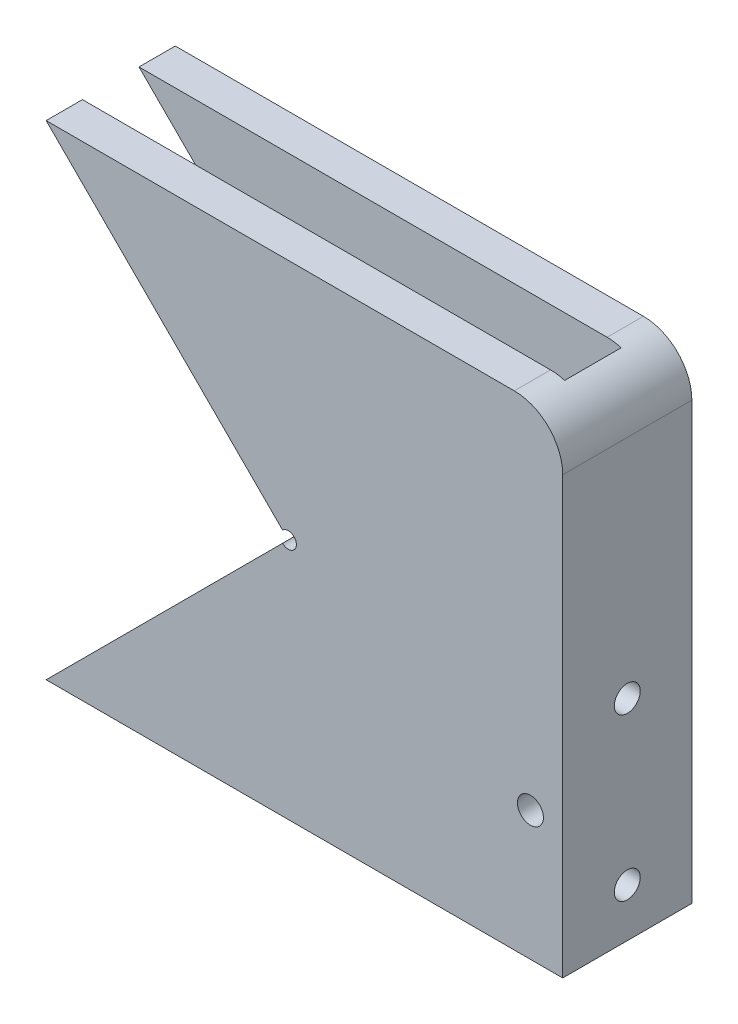
ISO-10303-21;
HEADER;
FILE_DESCRIPTION(('STEP AP214'),'2;1');
FILE_NAME('part.step','',(''),(''),'','','');
FILE_SCHEMA(('AUTOMOTIVE_DESIGN { 1 0 10303 214 1 1 1 1 }'));
ENDSEC;
DATA;
#1=APPLICATION_CONTEXT('core data for automotive mechanical design processes');
#2=APPLICATION_PROTOCOL_DEFINITION('international standard','automotive_design',2000,#1);
#3=PRODUCT_CONTEXT('',#1,'mechanical');
#4=PRODUCT('Part','Part','',(#3));
#5=PRODUCT_RELATED_PRODUCT_CATEGORY('part','',(#4));
#6=PRODUCT_DEFINITION_FORMATION('','',#4);
#7=PRODUCT_DEFINITION_CONTEXT('part definition',#1,'design');
#8=PRODUCT_DEFINITION('design','',#6,#7);
#9=PRODUCT_DEFINITION_SHAPE('','',#8);
#10=(LENGTH_UNIT() NAMED_UNIT(*) SI_UNIT(.MILLI.,.METRE.));
#11=(NAMED_UNIT(*) PLANE_ANGLE_UNIT() SI_UNIT($,.RADIAN.));
#12=(NAMED_UNIT(*) SI_UNIT($,.STERADIAN.) SOLID_ANGLE_UNIT());
#13=UNCERTAINTY_MEASURE_WITH_UNIT(LENGTH_MEASURE(1.E-05),#10,'distance_accuracy_value','');
#14=(GEOMETRIC_REPRESENTATION_CONTEXT(3) GLOBAL_UNCERTAINTY_ASSIGNED_CONTEXT((#13)) GLOBAL_UNIT_ASSIGNED_CONTEXT((#10,
#11,#12)) REPRESENTATION_CONTEXT('',''));
#15=CARTESIAN_POINT('',(0.,0.,0.));
#16=DIRECTION('',(0.,0.,1.));
#17=DIRECTION('',(1.,0.,0.));
#18=AXIS2_PLACEMENT_3D('',#15,#16,#17);
#19=CARTESIAN_POINT('',(-23.8125000000003,71.4375,12.7));
#20=DIRECTION('',(0.,1.,0.));
#21=DIRECTION('',(-1.,0.,0.));
#22=AXIS2_PLACEMENT_3D('',#19,#20,#21);
#23=PLANE('',#22);
#24=DIRECTION('',(1.,0.,0.));
#25=VECTOR('',#24,1.);
#26=CARTESIAN_POINT('',(-23.8125000000003,71.4375,12.7));
#27=LINE('',#26,#25);
#28=CARTESIAN_POINT('',(-23.8125000000003,71.4375,12.7));
#29=VERTEX_POINT('',#28);
#30=CARTESIAN_POINT('',(68.2624999999997,71.4375,12.7));
#31=VERTEX_POINT('',#30);
#32=EDGE_CURVE('E246',#29,#31,#27,.T.);
#33=ORIENTED_EDGE('',*,*,#32,.T.);
#34=DIRECTION('',(0.,0.,-1.));
#35=VECTOR('',#34,1.);
#36=CARTESIAN_POINT('',(68.2624999999997,71.4375,-12.7));
#37=LINE('',#36,#35);
#38=CARTESIAN_POINT('',(68.2624999999997,71.4375,5.5626));
#39=VERTEX_POINT('',#38);
#40=EDGE_CURVE('E328',#31,#39,#37,.T.);
#41=ORIENTED_EDGE('',*,*,#40,.T.);
#42=DIRECTION('',(-1.,0.,0.));
#43=VECTOR('',#42,1.);
#44=CARTESIAN_POINT('',(-23.8125000000003,71.4375,5.5626));
#45=LINE('',#44,#43);
#46=CARTESIAN_POINT('',(-23.8125000000002,71.4375,5.5626));
#47=VERTEX_POINT('',#46);
#48=EDGE_CURVE('E322',#39,#47,#45,.T.);
#49=ORIENTED_EDGE('',*,*,#48,.T.);
#50=DIRECTION('',(0.,0.,-1.));
#51=VECTOR('',#50,1.);
#52=CARTESIAN_POINT('',(-23.8125000000003,71.4375,12.7));
#53=LINE('',#52,#51);
#54=EDGE_CURVE('E260',#29,#47,#53,.T.);
#55=ORIENTED_EDGE('',*,*,#54,.F.);
#56=EDGE_LOOP('',(#33,#41,#49,#55));
#57=FACE_BOUND('',#56,.T.);
#58=ADVANCED_FACE('F47',(#57),#23,.T.);
#59=CARTESIAN_POINT('',(74.6124999999997,-26.9875,-5.5626));
#60=DIRECTION('',(0.707106781186551,0.707106781186544,0.));
#61=DIRECTION('',(-0.707106781186544,0.707106781186551,0.));
#62=AXIS2_PLACEMENT_3D('',#59,#60,#61);
#63=PLANE('',#62);
#64=DIRECTION('',(0.707106781186551,-0.707106781186544,0.));
#65=VECTOR('',#64,1.);
#66=CARTESIAN_POINT('',(-23.8125000000002,71.4375,5.5626));
#67=LINE('',#66,#65);
#68=CARTESIAN_POINT('',(22.6899679848666,24.9350320151337,5.5626));
#69=VERTEX_POINT('',#68);
#70=EDGE_CURVE('E230',#47,#69,#67,.T.);
#71=ORIENTED_EDGE('',*,*,#70,.T.);
#72=DIRECTION('',(0.,0.,1.));
#73=VECTOR('',#72,1.);
#74=CARTESIAN_POINT('',(22.6899679848666,24.9350320151337,-12.7));
#75=LINE('',#74,#73);
#76=CARTESIAN_POINT('',(22.6899679848666,24.9350320151336,12.7));
#77=VERTEX_POINT('',#76);
#78=EDGE_CURVE('E206',#69,#77,#75,.T.);
#79=ORIENTED_EDGE('',*,*,#78,.T.);
#80=DIRECTION('',(-0.707106781186551,0.707106781186544,0.));
#81=VECTOR('',#80,1.);
#82=CARTESIAN_POINT('',(23.8125000000002,23.8125,12.7));
#83=LINE('',#82,#81);
#84=EDGE_CURVE('E250',#77,#29,#83,.T.);
#85=ORIENTED_EDGE('',*,*,#84,.T.);
#86=ORIENTED_EDGE('',*,*,#54,.T.);
#87=EDGE_LOOP('',(#71,#79,#85,#86));
#88=FACE_BOUND('',#87,.T.);
#89=ADVANCED_FACE('F413',(#88),#63,.F.);
#90=CARTESIAN_POINT('',(61.9124999999998,-14.2875,0.));
#91=DIRECTION('',(0.707106781186551,0.707106781186544,0.));
#92=DIRECTION('',(0.707106781186544,-0.707106781186551,0.));
#93=AXIS2_PLACEMENT_3D('',#90,#91,#92);
#94=ELLIPSE('',#93,3.61006296066976,2.55269999999999);
#95=CARTESIAN_POINT('',(64.4651999999998,-16.8402,0.));
#96=VERTEX_POINT('',#95);
#97=EDGE_CURVE('E183',#96,#96,#94,.T.);
#98=ORIENTED_EDGE('',*,*,#97,.T.);
#99=EDGE_LOOP('',(#98));
#100=FACE_BOUND('',#99,.T.);
#101=DIRECTION('',(-0.707106781186544,0.707106781186551,0.));
#102=VECTOR('',#101,1.);
#103=CARTESIAN_POINT('',(74.6124999999997,-26.9875,5.5626));
#104=LINE('',#103,#102);
#105=CARTESIAN_POINT('',(71.4374999999997,-23.8125,5.5626));
#106=VERTEX_POINT('',#105);
#107=CARTESIAN_POINT('',(24.9350320151339,22.6899679848664,5.5626));
#108=VERTEX_POINT('',#107);
#109=EDGE_CURVE('E271',#106,#108,#104,.T.);
#110=ORIENTED_EDGE('',*,*,#109,.T.);
#111=DIRECTION('',(0.,0.,1.));
#112=VECTOR('',#111,1.);
#113=CARTESIAN_POINT('',(24.9350320151339,22.6899679848664,-12.7));
#114=LINE('',#113,#112);
#115=CARTESIAN_POINT('',(24.9350320151339,22.6899679848664,-5.5626));
#116=VERTEX_POINT('',#115);
#117=EDGE_CURVE('E218',#108,#116,#114,.F.);
#118=ORIENTED_EDGE('',*,*,#117,.T.);
#119=DIRECTION('',(-0.707106781186544,0.707106781186551,0.));
#120=VECTOR('',#119,1.);
#121=CARTESIAN_POINT('',(74.6124999999997,-26.9875,-5.5626));
#122=LINE('',#121,#120);
#123=CARTESIAN_POINT('',(71.4374999999997,-23.8125,-5.5626));
#124=VERTEX_POINT('',#123);
#125=EDGE_CURVE('E272',#124,#116,#122,.T.);
#126=ORIENTED_EDGE('',*,*,#125,.F.);
#127=DIRECTION('',(0.,0.,-1.));
#128=VECTOR('',#127,1.);
#129=CARTESIAN_POINT('',(71.4374999999997,-23.8125,12.7));
#130=LINE('',#129,#128);
#131=EDGE_CURVE('E306',#106,#124,#130,.T.);
#132=ORIENTED_EDGE('',*,*,#131,.F.);
#133=EDGE_LOOP('',(#110,#118,#126,#132));
#134=FACE_BOUND('',#133,.T.);
#135=ADVANCED_FACE('F407',(#100,#134),#63,.F.);
#136=DIRECTION('',(-0.707106781186551,0.707106781186544,0.));
#137=VECTOR('',#136,1.);
#138=CARTESIAN_POINT('',(23.8125000000002,23.8125,-12.7));
#139=LINE('',#138,#137);
#140=CARTESIAN_POINT('',(22.6899679848666,24.9350320151336,-12.7));
#141=VERTEX_POINT('',#140);
#142=CARTESIAN_POINT('',(-23.8125000000003,71.4375,-12.7));
#143=VERTEX_POINT('',#142);
#144=EDGE_CURVE('E251',#141,#143,#139,.T.);
#145=ORIENTED_EDGE('',*,*,#144,.F.);
#146=DIRECTION('',(0.,0.,1.));
#147=VECTOR('',#146,1.);
#148=CARTESIAN_POINT('',(22.6899679848666,24.9350320151337,-12.7));
#149=LINE('',#148,#147);
#150=CARTESIAN_POINT('',(22.6899679848666,24.9350320151337,-5.5626));
#151=VERTEX_POINT('',#150);
#152=EDGE_CURVE('E202',#141,#151,#149,.T.);
#153=ORIENTED_EDGE('',*,*,#152,.T.);
#154=DIRECTION('',(-0.707106781186551,0.707106781186544,0.));
#155=VECTOR('',#154,1.);
#156=CARTESIAN_POINT('',(-23.8125000000002,71.4375,-5.5626));
#157=LINE('',#156,#155);
#158=CARTESIAN_POINT('',(-23.8125000000002,71.4375,-5.5626));
#159=VERTEX_POINT('',#158);
#160=EDGE_CURVE('E234',#151,#159,#157,.T.);
#161=ORIENTED_EDGE('',*,*,#160,.T.);
#162=EDGE_CURVE('E254',#159,#143,#53,.T.);
#163=ORIENTED_EDGE('',*,*,#162,.T.);
#164=EDGE_LOOP('',(#145,#153,#161,#163));
#165=FACE_BOUND('',#164,.T.);
#166=ADVANCED_FACE('F383',(#165),#63,.F.);
#167=DIRECTION('',(1.,0.,0.));
#168=VECTOR('',#167,1.);
#169=CARTESIAN_POINT('',(-23.8125000000003,71.4375,-5.5626));
#170=LINE('',#169,#168);
#171=CARTESIAN_POINT('',(68.2624999999997,71.4375,-5.5626));
#172=VERTEX_POINT('',#171);
#173=EDGE_CURVE('E318',#159,#172,#170,.T.);
#174=ORIENTED_EDGE('',*,*,#173,.T.);
#175=DIRECTION('',(0.,0.,-1.));
#176=VECTOR('',#175,1.);
#177=CARTESIAN_POINT('',(68.2624999999997,71.4375,-12.7));
#178=LINE('',#177,#176);
#179=CARTESIAN_POINT('',(68.2624999999997,71.4375,-12.7));
#180=VERTEX_POINT('',#179);
#181=EDGE_CURVE('E325',#172,#180,#178,.T.);
#182=ORIENTED_EDGE('',*,*,#181,.T.);
#183=DIRECTION('',(1.,0.,0.));
#184=VECTOR('',#183,1.);
#185=CARTESIAN_POINT('',(-23.8125000000003,71.4375,-12.7));
#186=LINE('',#185,#184);
#187=EDGE_CURVE('E242',#143,#180,#186,.T.);
#188=ORIENTED_EDGE('',*,*,#187,.F.);
#189=ORIENTED_EDGE('',*,*,#162,.F.);
#190=EDGE_LOOP('',(#174,#182,#188,#189));
#191=FACE_BOUND('',#190,.T.);
#192=ADVANCED_FACE('F374',(#191),#23,.T.);
#193=CARTESIAN_POINT('',(23.8125000000002,23.8125,12.7));
#194=DIRECTION('',(0.707106781186544,-0.707106781186551,0.));
#195=DIRECTION('',(0.707106781186551,0.707106781186544,0.));
#196=AXIS2_PLACEMENT_3D('',#193,#194,#195);
#197=PLANE('',#196);
#198=DIRECTION('',(-0.707106781186551,-0.707106781186544,0.));
#199=VECTOR('',#198,1.);
#200=CARTESIAN_POINT('',(23.8125000000002,23.8125,12.7));
#201=LINE('',#200,#199);
#202=CARTESIAN_POINT('',(22.6899679848666,22.6899679848664,12.7));
#203=VERTEX_POINT('',#202);
#204=CARTESIAN_POINT('',(-23.8125000000002,-23.8125,12.7));
#205=VERTEX_POINT('',#204);
#206=EDGE_CURVE('E280',#203,#205,#201,.T.);
#207=ORIENTED_EDGE('',*,*,#206,.F.);
#208=DIRECTION('',(0.,0.,1.));
#209=VECTOR('',#208,1.);
#210=CARTESIAN_POINT('',(22.6899679848666,22.6899679848664,-12.7));
#211=LINE('',#210,#209);
#212=CARTESIAN_POINT('',(22.6899679848666,22.6899679848664,5.5626));
#213=VERTEX_POINT('',#212);
#214=EDGE_CURVE('E226',#203,#213,#211,.F.);
#215=ORIENTED_EDGE('',*,*,#214,.T.);
#216=DIRECTION('',(0.707106781186551,0.707106781186544,0.));
#217=VECTOR('',#216,1.);
#218=CARTESIAN_POINT('',(-23.8125000000002,-23.8125,5.5626));
#219=LINE('',#218,#217);
#220=CARTESIAN_POINT('',(-23.8125000000002,-23.8125,5.5626));
#221=VERTEX_POINT('',#220);
#222=EDGE_CURVE('E264',#221,#213,#219,.T.);
#223=ORIENTED_EDGE('',*,*,#222,.F.);
#224=DIRECTION('',(0.,0.,-1.));
#225=VECTOR('',#224,1.);
#226=CARTESIAN_POINT('',(-23.8125000000002,-23.8125,12.7));
#227=LINE('',#226,#225);
#228=EDGE_CURVE('E302',#205,#221,#227,.T.);
#229=ORIENTED_EDGE('',*,*,#228,.F.);
#230=EDGE_LOOP('',(#207,#215,#223,#229));
#231=FACE_BOUND('',#230,.T.);
#232=ADVANCED_FACE('F402',(#231),#197,.F.);
#233=DIRECTION('',(-0.707106781186551,-0.707106781186544,0.));
#234=VECTOR('',#233,1.);
#235=CARTESIAN_POINT('',(-23.8125000000002,-23.8125,-5.5626));
#236=LINE('',#235,#234);
#237=CARTESIAN_POINT('',(22.6899679848666,22.6899679848664,-5.5626));
#238=VERTEX_POINT('',#237);
#239=CARTESIAN_POINT('',(-23.8125000000002,-23.8125,-5.5626));
#240=VERTEX_POINT('',#239);
#241=EDGE_CURVE('E268',#238,#240,#236,.T.);
#242=ORIENTED_EDGE('',*,*,#241,.F.);
#243=DIRECTION('',(0.,0.,1.));
#244=VECTOR('',#243,1.);
#245=CARTESIAN_POINT('',(22.6899679848666,22.6899679848664,-12.7));
#246=LINE('',#245,#244);
#247=CARTESIAN_POINT('',(22.6899679848666,22.6899679848664,-12.7));
#248=VERTEX_POINT('',#247);
#249=EDGE_CURVE('E214',#238,#248,#246,.F.);
#250=ORIENTED_EDGE('',*,*,#249,.T.);
#251=DIRECTION('',(-0.707106781186551,-0.707106781186544,0.));
#252=VECTOR('',#251,1.);
#253=CARTESIAN_POINT('',(23.8125000000002,23.8125,-12.7));
#254=LINE('',#253,#252);
#255=CARTESIAN_POINT('',(-23.8125000000002,-23.8125,-12.7));
#256=VERTEX_POINT('',#255);
#257=EDGE_CURVE('E276',#248,#256,#254,.T.);
#258=ORIENTED_EDGE('',*,*,#257,.T.);
#259=EDGE_CURVE('E301',#240,#256,#227,.T.);
#260=ORIENTED_EDGE('',*,*,#259,.F.);
#261=EDGE_LOOP('',(#242,#250,#258,#260));
#262=FACE_BOUND('',#261,.T.);
#263=ADVANCED_FACE('F410',(#262),#197,.F.);
#264=CARTESIAN_POINT('',(-23.8125000000002,-23.8125,12.7));
#265=DIRECTION('',(0.,1.,0.));
#266=DIRECTION('',(0.,0.,1.));
#267=AXIS2_PLACEMENT_3D('',#264,#265,#266);
#268=PLANE('',#267);
#269=ORIENTED_EDGE('',*,*,#228,.T.);
#270=DIRECTION('',(1.,0.,0.));
#271=VECTOR('',#270,1.);
#272=CARTESIAN_POINT('',(-23.8125000000002,-23.8125,5.5626));
#273=LINE('',#272,#271);
#274=EDGE_CURVE('E314',#221,#106,#273,.T.);
#275=ORIENTED_EDGE('',*,*,#274,.T.);
#276=ORIENTED_EDGE('',*,*,#131,.T.);
#277=DIRECTION('',(-1.,0.,0.));
#278=VECTOR('',#277,1.);
#279=CARTESIAN_POINT('',(-23.8125000000002,-23.8125,-5.5626));
#280=LINE('',#279,#278);
#281=EDGE_CURVE('E310',#124,#240,#280,.T.);
#282=ORIENTED_EDGE('',*,*,#281,.T.);
#283=ORIENTED_EDGE('',*,*,#259,.T.);
#284=DIRECTION('',(1.,0.,0.));
#285=VECTOR('',#284,1.);
#286=CARTESIAN_POINT('',(-23.8125000000002,-23.8125,-12.7));
#287=LINE('',#286,#285);
#288=CARTESIAN_POINT('',(77.7874999999997,-23.8125,-12.7));
#289=VERTEX_POINT('',#288);
#290=EDGE_CURVE('E293',#256,#289,#287,.T.);
#291=ORIENTED_EDGE('',*,*,#290,.T.);
#292=DIRECTION('',(0.,0.,-1.));
#293=VECTOR('',#292,1.);
#294=CARTESIAN_POINT('',(77.7874999999997,-23.8125,12.7));
#295=LINE('',#294,#293);
#296=CARTESIAN_POINT('',(77.7874999999997,-23.8125,12.7));
#297=VERTEX_POINT('',#296);
#298=EDGE_CURVE('E290',#297,#289,#295,.T.);
#299=ORIENTED_EDGE('',*,*,#298,.F.);
#300=DIRECTION('',(1.,0.,0.));
#301=VECTOR('',#300,1.);
#302=CARTESIAN_POINT('',(-23.8125000000002,-23.8125,12.7));
#303=LINE('',#302,#301);
#304=EDGE_CURVE('E283',#205,#297,#303,.T.);
#305=ORIENTED_EDGE('',*,*,#304,.F.);
#306=EDGE_LOOP('',(#269,#275,#276,#282,#283,#291,#299,#305));
#307=FACE_BOUND('',#306,.T.);
#308=ADVANCED_FACE('F390',(#307),#268,.F.);
#309=CARTESIAN_POINT('',(77.7874999999997,-23.8125,12.7));
#310=DIRECTION('',(-1.,0.,0.));
#311=DIRECTION('',(0.,0.,1.));
#312=AXIS2_PLACEMENT_3D('',#309,#310,#311);
#313=PLANE('',#312);
#314=CARTESIAN_POINT('',(77.7874999999997,-14.2875,0.));
#315=DIRECTION('',(1.,0.,0.));
#316=DIRECTION('',(0.,0.,-1.));
#317=AXIS2_PLACEMENT_3D('',#314,#315,#316);
#318=CIRCLE('',#317,2.55269999999999);
#319=CARTESIAN_POINT('',(77.7874999999997,-14.2875,-2.55269999999999));
#320=VERTEX_POINT('',#319);
#321=EDGE_CURVE('E569',#320,#320,#318,.T.);
#322=ORIENTED_EDGE('',*,*,#321,.F.);
#323=EDGE_LOOP('',(#322));
#324=FACE_BOUND('',#323,.T.);
#325=CARTESIAN_POINT('',(77.7874999999997,17.4625,0.));
#326=DIRECTION('',(1.,0.,0.));
#327=DIRECTION('',(0.,0.,-1.));
#328=AXIS2_PLACEMENT_3D('',#325,#326,#327);
#329=CIRCLE('',#328,2.55269999999999);
#330=CARTESIAN_POINT('',(77.7874999999997,17.4625,-2.55269999999999));
#331=VERTEX_POINT('',#330);
#332=EDGE_CURVE('E175',#331,#331,#329,.T.);
#333=ORIENTED_EDGE('',*,*,#332,.F.);
#334=EDGE_LOOP('',(#333));
#335=FACE_BOUND('',#334,.T.);
#336=DIRECTION('',(0.,1.,0.));
#337=VECTOR('',#336,1.);
#338=CARTESIAN_POINT('',(77.7874999999997,-23.8125,-12.7));
#339=LINE('',#338,#337);
#340=CARTESIAN_POINT('',(77.7874999999997,61.9125,-12.7));
#341=VERTEX_POINT('',#340);
#342=EDGE_CURVE('E284',#289,#341,#339,.T.);
#343=ORIENTED_EDGE('',*,*,#342,.T.);
#344=DIRECTION('',(0.,0.,-1.));
#345=VECTOR('',#344,1.);
#346=CARTESIAN_POINT('',(77.7874999999997,61.9125,12.7));
#347=LINE('',#346,#345);
#348=CARTESIAN_POINT('',(77.7874999999997,61.9125,12.7));
#349=VERTEX_POINT('',#348);
#350=EDGE_CURVE('E70',#341,#349,#347,.F.);
#351=ORIENTED_EDGE('',*,*,#350,.T.);
#352=DIRECTION('',(0.,1.,0.));
#353=VECTOR('',#352,1.);
#354=CARTESIAN_POINT('',(77.7874999999997,-23.8125,12.7));
#355=LINE('',#354,#353);
#356=EDGE_CURVE('E287',#297,#349,#355,.T.);
#357=ORIENTED_EDGE('',*,*,#356,.F.);
#358=ORIENTED_EDGE('',*,*,#298,.T.);
#359=EDGE_LOOP('',(#343,#351,#357,#358));
#360=FACE_BOUND('',#359,.T.);
#361=ADVANCED_FACE('F395',(#324,#335,#360),#313,.F.);
#362=CARTESIAN_POINT('',(0.,0.,12.7));
#363=DIRECTION('',(0.,0.,-1.));
#364=DIRECTION('',(-1.,0.,0.));
#365=AXIS2_PLACEMENT_3D('',#362,#363,#364);
#366=PLANE('',#365);
#367=CARTESIAN_POINT('',(71.4374999999997,1.58750000000001,12.7));
#368=DIRECTION('',(0.,0.,1.));
#369=DIRECTION('',(1.,0.,0.));
#370=AXIS2_PLACEMENT_3D('',#367,#368,#369);
#371=CIRCLE('',#370,2.55269999999999);
#372=CARTESIAN_POINT('',(73.9901999999997,1.58750000000001,12.7));
#373=VERTEX_POINT('',#372);
#374=EDGE_CURVE('E174',#373,#373,#371,.T.);
#375=ORIENTED_EDGE('',*,*,#374,.F.);
#376=EDGE_LOOP('',(#375));
#377=FACE_BOUND('',#376,.T.);
#378=ORIENTED_EDGE('',*,*,#84,.F.);
#379=CARTESIAN_POINT('',(23.8125000000002,23.8125,12.7));
#380=DIRECTION('',(0.,0.,1.));
#381=DIRECTION('',(1.,0.,0.));
#382=AXIS2_PLACEMENT_3D('',#379,#380,#381);
#383=CIRCLE('',#382,1.5875);
#384=EDGE_CURVE('E190',#203,#77,#383,.T.);
#385=ORIENTED_EDGE('',*,*,#384,.F.);
#386=ORIENTED_EDGE('',*,*,#206,.T.);
#387=ORIENTED_EDGE('',*,*,#304,.T.);
#388=ORIENTED_EDGE('',*,*,#356,.T.);
#389=CARTESIAN_POINT('',(68.2624999999997,61.9125,12.7));
#390=DIRECTION('',(0.,0.,-1.));
#391=DIRECTION('',(-1.,0.,0.));
#392=AXIS2_PLACEMENT_3D('',#389,#390,#391);
#393=CIRCLE('',#392,9.525);
#394=EDGE_CURVE('E56',#349,#31,#393,.F.);
#395=ORIENTED_EDGE('',*,*,#394,.T.);
#396=ORIENTED_EDGE('',*,*,#32,.F.);
#397=EDGE_LOOP('',(#378,#385,#386,#387,#388,#395,#396));
#398=FACE_BOUND('',#397,.T.);
#399=ADVANCED_FACE('F350',(#377,#398),#366,.F.);
#400=CARTESIAN_POINT('',(0.,0.,-12.7));
#401=DIRECTION('',(0.,0.,-1.));
#402=DIRECTION('',(-1.,0.,0.));
#403=AXIS2_PLACEMENT_3D('',#400,#401,#402);
#404=PLANE('',#403);
#405=CARTESIAN_POINT('',(71.4374999999997,1.58750000000001,-12.7));
#406=DIRECTION('',(0.,0.,1.));
#407=DIRECTION('',(1.,0.,0.));
#408=AXIS2_PLACEMENT_3D('',#405,#406,#407);
#409=CIRCLE('',#408,2.55269999999999);
#410=CARTESIAN_POINT('',(73.9901999999997,1.58750000000001,-12.7));
#411=VERTEX_POINT('',#410);
#412=EDGE_CURVE('E180',#411,#411,#409,.T.);
#413=ORIENTED_EDGE('',*,*,#412,.T.);
#414=EDGE_LOOP('',(#413));
#415=FACE_BOUND('',#414,.T.);
#416=CARTESIAN_POINT('',(23.8125000000002,23.8125,-12.7));
#417=DIRECTION('',(0.,0.,1.));
#418=DIRECTION('',(1.,0.,0.));
#419=AXIS2_PLACEMENT_3D('',#416,#417,#418);
#420=CIRCLE('',#419,1.5875);
#421=EDGE_CURVE('E191',#248,#141,#420,.T.);
#422=ORIENTED_EDGE('',*,*,#421,.T.);
#423=ORIENTED_EDGE('',*,*,#144,.T.);
#424=ORIENTED_EDGE('',*,*,#187,.T.);
#425=CARTESIAN_POINT('',(68.2624999999997,61.9125,-12.7));
#426=DIRECTION('',(0.,0.,-1.));
#427=DIRECTION('',(-1.,0.,0.));
#428=AXIS2_PLACEMENT_3D('',#425,#426,#427);
#429=CIRCLE('',#428,9.525);
#430=EDGE_CURVE('E341',#180,#341,#429,.T.);
#431=ORIENTED_EDGE('',*,*,#430,.T.);
#432=ORIENTED_EDGE('',*,*,#342,.F.);
#433=ORIENTED_EDGE('',*,*,#290,.F.);
#434=ORIENTED_EDGE('',*,*,#257,.F.);
#435=EDGE_LOOP('',(#422,#423,#424,#431,#432,#433,#434));
#436=FACE_BOUND('',#435,.T.);
#437=ADVANCED_FACE('F377',(#415,#436),#404,.T.);
#438=CARTESIAN_POINT('',(26.9874999999992,-74.6125,5.5626));
#439=DIRECTION('',(0.,0.,1.));
#440=DIRECTION('',(1.,0.,0.));
#441=AXIS2_PLACEMENT_3D('',#438,#439,#440);
#442=PLANE('',#441);
#443=ORIENTED_EDGE('',*,*,#222,.T.);
#444=CARTESIAN_POINT('',(23.8125000000002,23.8125,5.5626));
#445=DIRECTION('',(0.,0.,1.));
#446=DIRECTION('',(1.,0.,0.));
#447=AXIS2_PLACEMENT_3D('',#444,#445,#446);
#448=CIRCLE('',#447,1.5875);
#449=EDGE_CURVE('E222',#213,#108,#448,.T.);
#450=ORIENTED_EDGE('',*,*,#449,.T.);
#451=ORIENTED_EDGE('',*,*,#109,.F.);
#452=ORIENTED_EDGE('',*,*,#274,.F.);
#453=EDGE_LOOP('',(#443,#450,#451,#452));
#454=FACE_BOUND('',#453,.T.);
#455=ADVANCED_FACE('F404',(#454),#442,.F.);
#456=CARTESIAN_POINT('',(26.9874999999992,-74.6125,-5.5626));
#457=DIRECTION('',(0.,0.,-1.));
#458=DIRECTION('',(-1.,0.,0.));
#459=AXIS2_PLACEMENT_3D('',#456,#457,#458);
#460=PLANE('',#459);
#461=ORIENTED_EDGE('',*,*,#125,.T.);
#462=CARTESIAN_POINT('',(23.8125000000002,23.8125,-5.5626));
#463=DIRECTION('',(0.,0.,-1.));
#464=DIRECTION('',(-1.,0.,0.));
#465=AXIS2_PLACEMENT_3D('',#462,#463,#464);
#466=CIRCLE('',#465,1.5875);
#467=EDGE_CURVE('E210',#116,#238,#466,.T.);
#468=ORIENTED_EDGE('',*,*,#467,.T.);
#469=ORIENTED_EDGE('',*,*,#241,.T.);
#470=ORIENTED_EDGE('',*,*,#281,.F.);
#471=EDGE_LOOP('',(#461,#468,#469,#470));
#472=FACE_BOUND('',#471,.T.);
#473=ADVANCED_FACE('F409',(#472),#460,.F.);
#474=CARTESIAN_POINT('',(26.9874999999992,122.2375,5.5626));
#475=DIRECTION('',(0.,0.,-1.));
#476=DIRECTION('',(-1.,0.,0.));
#477=AXIS2_PLACEMENT_3D('',#474,#475,#476);
#478=PLANE('',#477);
#479=CARTESIAN_POINT('',(23.8125000000002,23.8125,5.5626));
#480=DIRECTION('',(0.,0.,-1.));
#481=DIRECTION('',(-1.,0.,0.));
#482=AXIS2_PLACEMENT_3D('',#479,#480,#481);
#483=CIRCLE('',#482,1.5875);
#484=CARTESIAN_POINT('',(24.9350320151339,24.9350320151337,5.5626));
#485=VERTEX_POINT('',#484);
#486=EDGE_CURVE('E199',#69,#485,#483,.T.);
#487=ORIENTED_EDGE('',*,*,#486,.F.);
#488=ORIENTED_EDGE('',*,*,#70,.F.);
#489=ORIENTED_EDGE('',*,*,#48,.F.);
#490=CARTESIAN_POINT('',(68.2624999999997,61.9125,5.5626));
#491=DIRECTION('',(0.,0.,-1.));
#492=DIRECTION('',(-1.,0.,0.));
#493=AXIS2_PLACEMENT_3D('',#490,#491,#492);
#494=CIRCLE('',#493,9.525);
#495=CARTESIAN_POINT('',(71.0273811015034,71.0273811015036,5.5626));
#496=VERTEX_POINT('',#495);
#497=EDGE_CURVE('E332',#39,#496,#494,.T.);
#498=ORIENTED_EDGE('',*,*,#497,.T.);
#499=DIRECTION('',(-0.707106781186544,-0.707106781186551,0.));
#500=VECTOR('',#499,1.);
#501=CARTESIAN_POINT('',(74.6124999999997,74.6125,5.5626));
#502=LINE('',#501,#500);
#503=EDGE_CURVE('E238',#496,#485,#502,.T.);
#504=ORIENTED_EDGE('',*,*,#503,.T.);
#505=EDGE_LOOP('',(#487,#488,#489,#498,#504));
#506=FACE_BOUND('',#505,.T.);
#507=ADVANCED_FACE('F361',(#506),#478,.T.);
#508=CARTESIAN_POINT('',(74.6124999999997,74.6125,-5.5626));
#509=DIRECTION('',(-0.707106781186551,0.707106781186544,0.));
#510=DIRECTION('',(-0.707106781186544,-0.707106781186551,0.));
#511=AXIS2_PLACEMENT_3D('',#508,#509,#510);
#512=PLANE('',#511);
#513=DIRECTION('',(0.,0.,1.));
#514=VECTOR('',#513,1.);
#515=CARTESIAN_POINT('',(24.9350320151339,24.9350320151337,-12.7));
#516=LINE('',#515,#514);
#517=CARTESIAN_POINT('',(24.9350320151339,24.9350320151337,-5.5626));
#518=VERTEX_POINT('',#517);
#519=EDGE_CURVE('E62',#485,#518,#516,.F.);
#520=ORIENTED_EDGE('',*,*,#519,.F.);
#521=ORIENTED_EDGE('',*,*,#503,.F.);
#522=DIRECTION('',(0.,0.,1.));
#523=VECTOR('',#522,1.);
#524=CARTESIAN_POINT('',(71.0273811015034,71.0273811015036,5.5626));
#525=LINE('',#524,#523);
#526=CARTESIAN_POINT('',(71.0273811015034,71.0273811015036,-5.5626));
#527=VERTEX_POINT('',#526);
#528=EDGE_CURVE('E335',#496,#527,#525,.F.);
#529=ORIENTED_EDGE('',*,*,#528,.T.);
#530=DIRECTION('',(-0.707106781186544,-0.707106781186551,0.));
#531=VECTOR('',#530,1.);
#532=CARTESIAN_POINT('',(74.6124999999997,74.6125,-5.5626));
#533=LINE('',#532,#531);
#534=EDGE_CURVE('E237',#527,#518,#533,.T.);
#535=ORIENTED_EDGE('',*,*,#534,.T.);
#536=EDGE_LOOP('',(#520,#521,#529,#535));
#537=FACE_BOUND('',#536,.T.);
#538=ADVANCED_FACE('F364',(#537),#512,.T.);
#539=CARTESIAN_POINT('',(26.9874999999992,122.2375,-5.5626));
#540=DIRECTION('',(0.,0.,1.));
#541=DIRECTION('',(1.,0.,0.));
#542=AXIS2_PLACEMENT_3D('',#539,#540,#541);
#543=PLANE('',#542);
#544=CARTESIAN_POINT('',(23.8125000000002,23.8125,-5.5626));
#545=DIRECTION('',(0.,0.,1.));
#546=DIRECTION('',(1.,0.,0.));
#547=AXIS2_PLACEMENT_3D('',#544,#545,#546);
#548=CIRCLE('',#547,1.5875);
#549=EDGE_CURVE('E11',#518,#151,#548,.T.);
#550=ORIENTED_EDGE('',*,*,#549,.F.);
#551=ORIENTED_EDGE('',*,*,#534,.F.);
#552=CARTESIAN_POINT('',(68.2624999999997,61.9125,-5.5626));
#553=DIRECTION('',(0.,0.,1.));
#554=DIRECTION('',(1.,0.,0.));
#555=AXIS2_PLACEMENT_3D('',#552,#553,#554);
#556=CIRCLE('',#555,9.525);
#557=EDGE_CURVE('E338',#527,#172,#556,.T.);
#558=ORIENTED_EDGE('',*,*,#557,.T.);
#559=ORIENTED_EDGE('',*,*,#173,.F.);
#560=ORIENTED_EDGE('',*,*,#160,.F.);
#561=EDGE_LOOP('',(#550,#551,#558,#559,#560));
#562=FACE_BOUND('',#561,.T.);
#563=ADVANCED_FACE('F367',(#562),#543,.T.);
#564=CARTESIAN_POINT('',(68.2624999999997,61.9125,12.7));
#565=DIRECTION('',(0.,0.,1.));
#566=DIRECTION('',(1.,0.,0.));
#567=AXIS2_PLACEMENT_3D('',#564,#565,#566);
#568=CYLINDRICAL_SURFACE('',#567,9.525);
#569=ORIENTED_EDGE('',*,*,#394,.F.);
#570=ORIENTED_EDGE('',*,*,#350,.F.);
#571=ORIENTED_EDGE('',*,*,#430,.F.);
#572=ORIENTED_EDGE('',*,*,#181,.F.);
#573=ORIENTED_EDGE('',*,*,#557,.F.);
#574=ORIENTED_EDGE('',*,*,#528,.F.);
#575=ORIENTED_EDGE('',*,*,#497,.F.);
#576=ORIENTED_EDGE('',*,*,#40,.F.);
#577=EDGE_LOOP('',(#569,#570,#571,#572,#573,#574,#575,#576));
#578=FACE_BOUND('',#577,.T.);
#579=ADVANCED_FACE('F49',(#578),#568,.T.);
#580=CARTESIAN_POINT('',(23.8125000000002,23.8125,-12.7));
#581=DIRECTION('',(0.,0.,1.));
#582=DIRECTION('',(1.,0.,0.));
#583=AXIS2_PLACEMENT_3D('',#580,#581,#582);
#584=CYLINDRICAL_SURFACE('',#583,1.5875);
#585=ORIENTED_EDGE('',*,*,#384,.T.);
#586=ORIENTED_EDGE('',*,*,#78,.F.);
#587=ORIENTED_EDGE('',*,*,#486,.T.);
#588=ORIENTED_EDGE('',*,*,#519,.T.);
#589=ORIENTED_EDGE('',*,*,#549,.T.);
#590=ORIENTED_EDGE('',*,*,#152,.F.);
#591=ORIENTED_EDGE('',*,*,#421,.F.);
#592=ORIENTED_EDGE('',*,*,#249,.F.);
#593=ORIENTED_EDGE('',*,*,#467,.F.);
#594=ORIENTED_EDGE('',*,*,#117,.F.);
#595=ORIENTED_EDGE('',*,*,#449,.F.);
#596=ORIENTED_EDGE('',*,*,#214,.F.);
#597=EDGE_LOOP('',(#585,#586,#587,#588,#589,#590,#591,#592,#593,#594,#595,#596));
#598=FACE_BOUND('',#597,.T.);
#599=ADVANCED_FACE('F411',(#598),#584,.F.);
#600=CARTESIAN_POINT('',(71.4374999999997,1.58750000000001,12.7));
#601=DIRECTION('',(0.,0.,1.));
#602=DIRECTION('',(1.,0.,0.));
#603=AXIS2_PLACEMENT_3D('',#600,#601,#602);
#604=CYLINDRICAL_SURFACE('',#603,2.55269999999999);
#605=ORIENTED_EDGE('',*,*,#412,.F.);
#606=EDGE_LOOP('',(#605));
#607=FACE_BOUND('',#606,.T.);
#608=ORIENTED_EDGE('',*,*,#374,.T.);
#609=EDGE_LOOP('',(#608));
#610=FACE_BOUND('',#609,.T.);
#611=ADVANCED_FACE('F167',(#607,#610),#604,.F.);
#612=CARTESIAN_POINT('',(61.9124999999997,17.4625,0.));
#613=DIRECTION('',(1.,0.,0.));
#614=DIRECTION('',(0.,0.,-1.));
#615=AXIS2_PLACEMENT_3D('',#612,#613,#614);
#616=CONICAL_SURFACE('',#615,2.55269999999999,1.02974425867665);
#617=CARTESIAN_POINT('',(60.3786830978081,17.4625,0.));
#618=VERTEX_POINT('',#617);
#619=VERTEX_LOOP('',#618);
#620=FACE_BOUND('',#619,.T.);
#621=CARTESIAN_POINT('',(61.9124999999997,17.4625,0.));
#622=DIRECTION('',(1.,0.,0.));
#623=DIRECTION('',(0.,0.,-1.));
#624=AXIS2_PLACEMENT_3D('',#621,#622,#623);
#625=CIRCLE('',#624,2.55269999999999);
#626=CARTESIAN_POINT('',(61.9124999999997,17.4625,-2.55269999999999));
#627=VERTEX_POINT('',#626);
#628=EDGE_CURVE('E171',#627,#627,#625,.T.);
#629=ORIENTED_EDGE('',*,*,#628,.T.);
#630=EDGE_LOOP('',(#629));
#631=FACE_BOUND('',#630,.T.);
#632=ADVANCED_FACE('F163',(#620,#631),#616,.F.);
#633=CARTESIAN_POINT('',(77.7874999999997,17.4625,0.));
#634=DIRECTION('',(1.,0.,0.));
#635=DIRECTION('',(0.,0.,-1.));
#636=AXIS2_PLACEMENT_3D('',#633,#634,#635);
#637=CYLINDRICAL_SURFACE('',#636,2.55269999999999);
#638=ORIENTED_EDGE('',*,*,#628,.F.);
#639=EDGE_LOOP('',(#638));
#640=FACE_BOUND('',#639,.T.);
#641=ORIENTED_EDGE('',*,*,#332,.T.);
#642=EDGE_LOOP('',(#641));
#643=FACE_BOUND('',#642,.T.);
#644=ADVANCED_FACE('F166',(#640,#643),#637,.F.);
#645=CARTESIAN_POINT('',(77.7874999999997,-14.2875,0.));
#646=DIRECTION('',(1.,0.,0.));
#647=DIRECTION('',(0.,0.,-1.));
#648=AXIS2_PLACEMENT_3D('',#645,#646,#647);
#649=CYLINDRICAL_SURFACE('',#648,2.55269999999999);
#650=ORIENTED_EDGE('',*,*,#321,.T.);
#651=EDGE_LOOP('',(#650));
#652=FACE_BOUND('',#651,.T.);
#653=ORIENTED_EDGE('',*,*,#97,.F.);
#654=EDGE_LOOP('',(#653));
#655=FACE_BOUND('',#654,.T.);
#656=ADVANCED_FACE('F554',(#652,#655),#649,.F.);
#657=CLOSED_SHELL('',(#58,#89,#135,#166,#192,#232,#263,#308,#361,#399,#437,#455,#473,#507,#538,
#563,#579,#599,#611,#632,#644,#656));
#658=MANIFOLD_SOLID_BREP('B2',#657);
#659=ADVANCED_BREP_SHAPE_REPRESENTATION('',(#18,#658),#14);
#660=SHAPE_DEFINITION_REPRESENTATION(#9,#659);
ENDSEC;
END-ISO-10303-21;
